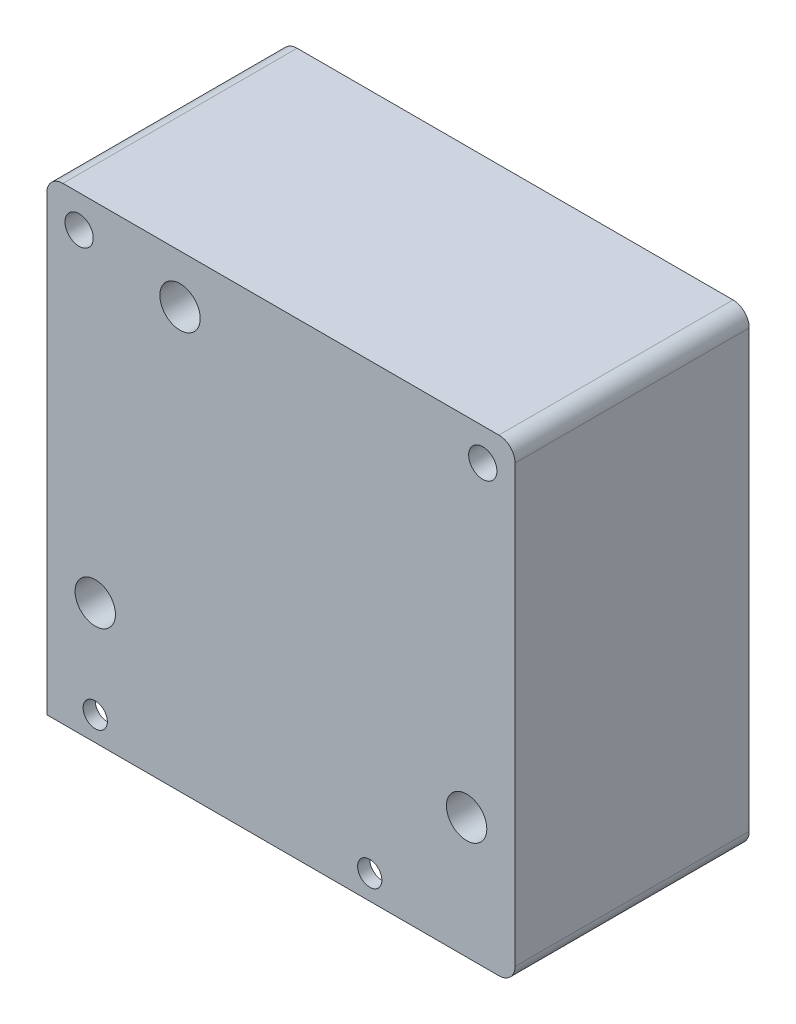
ISO-10303-21;
HEADER;
FILE_DESCRIPTION(('STEP AP214'),'2;1');
FILE_NAME('part.step','',(''),(''),'','','');
FILE_SCHEMA(('AUTOMOTIVE_DESIGN { 1 0 10303 214 1 1 1 1 }'));
ENDSEC;
DATA;
#1=APPLICATION_CONTEXT('core data for automotive mechanical design processes');
#2=APPLICATION_PROTOCOL_DEFINITION('international standard','automotive_design',2000,#1);
#3=PRODUCT_CONTEXT('',#1,'mechanical');
#4=PRODUCT('Part','Part','',(#3));
#5=PRODUCT_RELATED_PRODUCT_CATEGORY('part','',(#4));
#6=PRODUCT_DEFINITION_FORMATION('','',#4);
#7=PRODUCT_DEFINITION_CONTEXT('part definition',#1,'design');
#8=PRODUCT_DEFINITION('design','',#6,#7);
#9=PRODUCT_DEFINITION_SHAPE('','',#8);
#10=(LENGTH_UNIT() NAMED_UNIT(*) SI_UNIT(.MILLI.,.METRE.));
#11=(NAMED_UNIT(*) PLANE_ANGLE_UNIT() SI_UNIT($,.RADIAN.));
#12=(NAMED_UNIT(*) SI_UNIT($,.STERADIAN.) SOLID_ANGLE_UNIT());
#13=UNCERTAINTY_MEASURE_WITH_UNIT(LENGTH_MEASURE(1.E-05),#10,'distance_accuracy_value','');
#14=(GEOMETRIC_REPRESENTATION_CONTEXT(3) GLOBAL_UNCERTAINTY_ASSIGNED_CONTEXT((#13)) GLOBAL_UNIT_ASSIGNED_CONTEXT((#10,
#11,#12)) REPRESENTATION_CONTEXT('',''));
#15=CARTESIAN_POINT('',(0.,0.,0.));
#16=DIRECTION('',(0.,0.,1.));
#17=DIRECTION('',(1.,0.,0.));
#18=AXIS2_PLACEMENT_3D('',#15,#16,#17);
#19=CARTESIAN_POINT('',(-28.9999999999998,0.,29.));
#20=DIRECTION('',(1.,0.,0.));
#21=DIRECTION('',(0.,1.,0.));
#22=AXIS2_PLACEMENT_3D('',#19,#20,#21);
#23=PLANE('',#22);
#24=DIRECTION('',(0.,0.,-1.));
#25=VECTOR('',#24,1.);
#26=CARTESIAN_POINT('',(-28.9999999999998,-23.0000000000005,27.5));
#27=LINE('',#26,#25);
#28=CARTESIAN_POINT('',(-28.9999999999998,-23.0000000000005,27.5));
#29=VERTEX_POINT('',#28);
#30=CARTESIAN_POINT('',(-28.9999999999998,-23.0000000000005,0.));
#31=VERTEX_POINT('',#30);
#32=EDGE_CURVE('E160',#29,#31,#27,.T.);
#33=ORIENTED_EDGE('',*,*,#32,.F.);
#34=DIRECTION('',(0.,-1.,0.));
#35=VECTOR('',#34,1.);
#36=CARTESIAN_POINT('',(-28.9999999999985,1.64336137290879E-12,27.5));
#37=LINE('',#36,#35);
#38=CARTESIAN_POINT('',(-29.0000000000002,-28.9999999999998,27.5));
#39=VERTEX_POINT('',#38);
#40=EDGE_CURVE('E225',#29,#39,#37,.T.);
#41=ORIENTED_EDGE('',*,*,#40,.T.);
#42=DIRECTION('',(0.,0.,-1.));
#43=VECTOR('',#42,1.);
#44=CARTESIAN_POINT('',(-29.0000000000002,-28.9999999999998,29.));
#45=LINE('',#44,#43);
#46=CARTESIAN_POINT('',(-29.0000000000002,-28.9999999999998,29.));
#47=VERTEX_POINT('',#46);
#48=EDGE_CURVE('E11',#47,#39,#45,.T.);
#49=ORIENTED_EDGE('',*,*,#48,.F.);
#50=DIRECTION('',(0.,-1.,0.));
#51=VECTOR('',#50,1.);
#52=CARTESIAN_POINT('',(-28.9999999999998,0.,29.));
#53=LINE('',#52,#51);
#54=CARTESIAN_POINT('',(-28.9999999999998,27.0000000000002,29.));
#55=VERTEX_POINT('',#54);
#56=EDGE_CURVE('E185',#55,#47,#53,.T.);
#57=ORIENTED_EDGE('',*,*,#56,.F.);
#58=DIRECTION('',(0.,0.,-1.));
#59=VECTOR('',#58,1.);
#60=CARTESIAN_POINT('',(-28.9999999999998,27.0000000000002,29.));
#61=LINE('',#60,#59);
#62=CARTESIAN_POINT('',(-28.9999999999998,27.0000000000002,0.));
#63=VERTEX_POINT('',#62);
#64=EDGE_CURVE('E155',#55,#63,#61,.T.);
#65=ORIENTED_EDGE('',*,*,#64,.T.);
#66=DIRECTION('',(0.,-1.,0.));
#67=VECTOR('',#66,1.);
#68=CARTESIAN_POINT('',(-28.9999999999998,0.,0.));
#69=LINE('',#68,#67);
#70=EDGE_CURVE('E156',#63,#31,#69,.T.);
#71=ORIENTED_EDGE('',*,*,#70,.T.);
#72=EDGE_LOOP('',(#33,#41,#49,#57,#65,#71));
#73=FACE_BOUND('',#72,.T.);
#74=ADVANCED_FACE('F35',(#73),#23,.F.);
#75=CARTESIAN_POINT('',(0.,-29.0000000000002,29.));
#76=DIRECTION('',(0.,1.,0.));
#77=DIRECTION('',(0.,0.,1.));
#78=AXIS2_PLACEMENT_3D('',#75,#76,#77);
#79=PLANE('',#78);
#80=DIRECTION('',(0.,0.,-1.));
#81=VECTOR('',#80,1.);
#82=CARTESIAN_POINT('',(17.5000000000005,-29.0000000000002,27.5));
#83=LINE('',#82,#81);
#84=CARTESIAN_POINT('',(17.5000000000005,-29.0000000000002,27.5));
#85=VERTEX_POINT('',#84);
#86=CARTESIAN_POINT('',(17.5000000000005,-29.0000000000002,0.));
#87=VERTEX_POINT('',#86);
#88=EDGE_CURVE('E210',#85,#87,#83,.T.);
#89=ORIENTED_EDGE('',*,*,#88,.T.);
#90=DIRECTION('',(1.,0.,0.));
#91=VECTOR('',#90,1.);
#92=CARTESIAN_POINT('',(0.,-29.0000000000002,0.));
#93=LINE('',#92,#91);
#94=CARTESIAN_POINT('',(26.9999999999998,-29.0000000000002,0.));
#95=VERTEX_POINT('',#94);
#96=EDGE_CURVE('E159',#87,#95,#93,.T.);
#97=ORIENTED_EDGE('',*,*,#96,.T.);
#98=DIRECTION('',(0.,0.,-1.));
#99=VECTOR('',#98,1.);
#100=CARTESIAN_POINT('',(26.9999999999998,-29.0000000000002,29.));
#101=LINE('',#100,#99);
#102=CARTESIAN_POINT('',(26.9999999999998,-29.0000000000002,29.));
#103=VERTEX_POINT('',#102);
#104=EDGE_CURVE('E42',#103,#95,#101,.T.);
#105=ORIENTED_EDGE('',*,*,#104,.F.);
#106=DIRECTION('',(1.,0.,0.));
#107=VECTOR('',#106,1.);
#108=CARTESIAN_POINT('',(0.,-29.0000000000002,29.));
#109=LINE('',#108,#107);
#110=EDGE_CURVE('E93',#47,#103,#109,.T.);
#111=ORIENTED_EDGE('',*,*,#110,.F.);
#112=ORIENTED_EDGE('',*,*,#48,.T.);
#113=DIRECTION('',(1.,0.,0.));
#114=VECTOR('',#113,1.);
#115=CARTESIAN_POINT('',(-2.03391664323128E-13,-29.,27.5));
#116=LINE('',#115,#114);
#117=EDGE_CURVE('E222',#39,#85,#116,.T.);
#118=ORIENTED_EDGE('',*,*,#117,.T.);
#119=EDGE_LOOP('',(#89,#97,#105,#111,#112,#118));
#120=FACE_BOUND('',#119,.T.);
#121=ADVANCED_FACE('F267',(#120),#79,.F.);
#122=CARTESIAN_POINT('',(0.,0.,0.));
#123=DIRECTION('',(0.,0.,1.));
#124=DIRECTION('',(1.,0.,0.));
#125=AXIS2_PLACEMENT_3D('',#122,#123,#124);
#126=PLANE('',#125);
#127=CARTESIAN_POINT('',(-24.9999999999998,25.0000000000002,0.));
#128=DIRECTION('',(0.,0.,1.));
#129=DIRECTION('',(1.,0.,0.));
#130=AXIS2_PLACEMENT_3D('',#127,#128,#129);
#131=CIRCLE('',#130,1.75);
#132=CARTESIAN_POINT('',(-23.2499999999999,25.0000000000002,0.));
#133=VERTEX_POINT('',#132);
#134=EDGE_CURVE('E182',#133,#133,#131,.T.);
#135=ORIENTED_EDGE('',*,*,#134,.T.);
#136=EDGE_LOOP('',(#135));
#137=FACE_BOUND('',#136,.T.);
#138=CARTESIAN_POINT('',(-12.4999999999999,23.0000000000001,0.));
#139=DIRECTION('',(0.,0.,1.));
#140=DIRECTION('',(1.,0.,0.));
#141=AXIS2_PLACEMENT_3D('',#138,#139,#140);
#142=CIRCLE('',#141,2.5);
#143=CARTESIAN_POINT('',(-9.99999999999986,23.0000000000001,0.));
#144=VERTEX_POINT('',#143);
#145=EDGE_CURVE('E179',#144,#144,#142,.T.);
#146=ORIENTED_EDGE('',*,*,#145,.T.);
#147=EDGE_LOOP('',(#146));
#148=FACE_BOUND('',#147,.T.);
#149=CARTESIAN_POINT('',(25.0000000000002,24.9999999999999,0.));
#150=DIRECTION('',(0.,0.,1.));
#151=DIRECTION('',(1.,0.,0.));
#152=AXIS2_PLACEMENT_3D('',#149,#150,#151);
#153=CIRCLE('',#152,1.75);
#154=CARTESIAN_POINT('',(26.7500000000002,24.9999999999999,0.));
#155=VERTEX_POINT('',#154);
#156=EDGE_CURVE('E176',#155,#155,#153,.T.);
#157=ORIENTED_EDGE('',*,*,#156,.T.);
#158=EDGE_LOOP('',(#157));
#159=FACE_BOUND('',#158,.T.);
#160=CARTESIAN_POINT('',(-23.0000000000001,-13.9999999999999,0.));
#161=DIRECTION('',(0.,0.,1.));
#162=DIRECTION('',(1.,0.,0.));
#163=AXIS2_PLACEMENT_3D('',#160,#161,#162);
#164=CIRCLE('',#163,2.49999999999999);
#165=CARTESIAN_POINT('',(-20.5000000000001,-13.9999999999999,0.));
#166=VERTEX_POINT('',#165);
#167=EDGE_CURVE('E173',#166,#166,#164,.T.);
#168=ORIENTED_EDGE('',*,*,#167,.T.);
#169=EDGE_LOOP('',(#168));
#170=FACE_BOUND('',#169,.T.);
#171=CARTESIAN_POINT('',(22.9999999999999,-14.0000000000001,0.));
#172=DIRECTION('',(0.,0.,1.));
#173=DIRECTION('',(1.,0.,0.));
#174=AXIS2_PLACEMENT_3D('',#171,#172,#173);
#175=CIRCLE('',#174,2.49999999999999);
#176=CARTESIAN_POINT('',(25.4999999999999,-14.0000000000001,0.));
#177=VERTEX_POINT('',#176);
#178=EDGE_CURVE('E170',#177,#177,#175,.T.);
#179=ORIENTED_EDGE('',*,*,#178,.T.);
#180=EDGE_LOOP('',(#179));
#181=FACE_BOUND('',#180,.T.);
#182=DIRECTION('',(-1.,0.,0.));
#183=VECTOR('',#182,1.);
#184=CARTESIAN_POINT('',(0.,-23.0000000000005,0.));
#185=LINE('',#184,#183);
#186=CARTESIAN_POINT('',(17.5000000000005,-23.0000000000005,0.));
#187=VERTEX_POINT('',#186);
#188=EDGE_CURVE('E49',#187,#31,#185,.T.);
#189=ORIENTED_EDGE('',*,*,#188,.T.);
#190=ORIENTED_EDGE('',*,*,#70,.F.);
#191=CARTESIAN_POINT('',(-26.9999999999998,27.0000000000002,0.));
#192=DIRECTION('',(0.,0.,1.));
#193=DIRECTION('',(1.,0.,0.));
#194=AXIS2_PLACEMENT_3D('',#191,#192,#193);
#195=CIRCLE('',#194,2.);
#196=CARTESIAN_POINT('',(-26.9999999999998,29.0000000000002,0.));
#197=VERTEX_POINT('',#196);
#198=EDGE_CURVE('E85',#197,#63,#195,.T.);
#199=ORIENTED_EDGE('',*,*,#198,.F.);
#200=DIRECTION('',(-1.,0.,0.));
#201=VECTOR('',#200,1.);
#202=CARTESIAN_POINT('',(1.7141637903356E-13,29.,0.));
#203=LINE('',#202,#201);
#204=CARTESIAN_POINT('',(27.0000000000002,28.9999999999998,0.));
#205=VERTEX_POINT('',#204);
#206=EDGE_CURVE('E167',#205,#197,#203,.T.);
#207=ORIENTED_EDGE('',*,*,#206,.F.);
#208=CARTESIAN_POINT('',(27.0000000000002,26.9999999999998,0.));
#209=DIRECTION('',(0.,0.,1.));
#210=DIRECTION('',(1.,0.,0.));
#211=AXIS2_PLACEMENT_3D('',#208,#209,#210);
#212=CIRCLE('',#211,2.);
#213=CARTESIAN_POINT('',(29.0000000000002,26.9999999999998,0.));
#214=VERTEX_POINT('',#213);
#215=EDGE_CURVE('E123',#214,#205,#212,.T.);
#216=ORIENTED_EDGE('',*,*,#215,.F.);
#217=DIRECTION('',(0.,1.,0.));
#218=VECTOR('',#217,1.);
#219=CARTESIAN_POINT('',(29.,-1.78869265078497E-13,0.));
#220=LINE('',#219,#218);
#221=CARTESIAN_POINT('',(28.9999999999998,-27.0000000000002,0.));
#222=VERTEX_POINT('',#221);
#223=EDGE_CURVE('E164',#222,#214,#220,.T.);
#224=ORIENTED_EDGE('',*,*,#223,.F.);
#225=CARTESIAN_POINT('',(26.9999999999998,-27.0000000000002,0.));
#226=DIRECTION('',(0.,0.,1.));
#227=DIRECTION('',(1.,0.,0.));
#228=AXIS2_PLACEMENT_3D('',#225,#226,#227);
#229=CIRCLE('',#228,2.);
#230=EDGE_CURVE('E162',#95,#222,#229,.T.);
#231=ORIENTED_EDGE('',*,*,#230,.F.);
#232=ORIENTED_EDGE('',*,*,#96,.F.);
#233=DIRECTION('',(0.,1.,0.));
#234=VECTOR('',#233,1.);
#235=CARTESIAN_POINT('',(17.5000000000005,0.,0.));
#236=LINE('',#235,#234);
#237=EDGE_CURVE('E216',#87,#187,#236,.T.);
#238=ORIENTED_EDGE('',*,*,#237,.T.);
#239=EDGE_LOOP('',(#189,#190,#199,#207,#216,#224,#231,#232,#238));
#240=FACE_BOUND('',#239,.T.);
#241=ADVANCED_FACE('F201',(#137,#148,#159,#170,#181,#240),#126,.F.);
#242=CARTESIAN_POINT('',(26.9999999999998,-27.0000000000002,29.));
#243=DIRECTION('',(0.,0.,-1.));
#244=DIRECTION('',(-1.,0.,0.));
#245=AXIS2_PLACEMENT_3D('',#242,#243,#244);
#246=CYLINDRICAL_SURFACE('',#245,2.);
#247=ORIENTED_EDGE('',*,*,#230,.T.);
#248=DIRECTION('',(0.,0.,-1.));
#249=VECTOR('',#248,1.);
#250=CARTESIAN_POINT('',(28.9999999999998,-27.0000000000002,29.));
#251=LINE('',#250,#249);
#252=CARTESIAN_POINT('',(28.9999999999998,-27.0000000000002,29.));
#253=VERTEX_POINT('',#252);
#254=EDGE_CURVE('E189',#253,#222,#251,.T.);
#255=ORIENTED_EDGE('',*,*,#254,.F.);
#256=CARTESIAN_POINT('',(26.9999999999998,-27.0000000000002,29.));
#257=DIRECTION('',(0.,0.,1.));
#258=DIRECTION('',(1.,0.,0.));
#259=AXIS2_PLACEMENT_3D('',#256,#257,#258);
#260=CIRCLE('',#259,2.);
#261=EDGE_CURVE('E197',#103,#253,#260,.T.);
#262=ORIENTED_EDGE('',*,*,#261,.F.);
#263=ORIENTED_EDGE('',*,*,#104,.T.);
#264=EDGE_LOOP('',(#247,#255,#262,#263));
#265=FACE_BOUND('',#264,.T.);
#266=ADVANCED_FACE('F195',(#265),#246,.T.);
#267=CARTESIAN_POINT('',(29.,-1.78869265078497E-13,29.));
#268=DIRECTION('',(-1.,0.,0.));
#269=DIRECTION('',(0.,-1.,0.));
#270=AXIS2_PLACEMENT_3D('',#267,#268,#269);
#271=PLANE('',#270);
#272=ORIENTED_EDGE('',*,*,#223,.T.);
#273=DIRECTION('',(0.,0.,-1.));
#274=VECTOR('',#273,1.);
#275=CARTESIAN_POINT('',(29.0000000000002,26.9999999999998,29.));
#276=LINE('',#275,#274);
#277=CARTESIAN_POINT('',(29.0000000000002,26.9999999999998,29.));
#278=VERTEX_POINT('',#277);
#279=EDGE_CURVE('E126',#278,#214,#276,.T.);
#280=ORIENTED_EDGE('',*,*,#279,.F.);
#281=DIRECTION('',(0.,1.,0.));
#282=VECTOR('',#281,1.);
#283=CARTESIAN_POINT('',(29.,-1.78869265078497E-13,29.));
#284=LINE('',#283,#282);
#285=EDGE_CURVE('E114',#253,#278,#284,.T.);
#286=ORIENTED_EDGE('',*,*,#285,.F.);
#287=ORIENTED_EDGE('',*,*,#254,.T.);
#288=EDGE_LOOP('',(#272,#280,#286,#287));
#289=FACE_BOUND('',#288,.T.);
#290=ADVANCED_FACE('F204',(#289),#271,.F.);
#291=CARTESIAN_POINT('',(27.0000000000002,26.9999999999998,29.));
#292=DIRECTION('',(0.,0.,-1.));
#293=DIRECTION('',(-1.,0.,0.));
#294=AXIS2_PLACEMENT_3D('',#291,#292,#293);
#295=CYLINDRICAL_SURFACE('',#294,2.);
#296=ORIENTED_EDGE('',*,*,#215,.T.);
#297=DIRECTION('',(0.,0.,-1.));
#298=VECTOR('',#297,1.);
#299=CARTESIAN_POINT('',(27.0000000000002,28.9999999999998,29.));
#300=LINE('',#299,#298);
#301=CARTESIAN_POINT('',(27.0000000000002,28.9999999999998,29.));
#302=VERTEX_POINT('',#301);
#303=EDGE_CURVE('E120',#302,#205,#300,.T.);
#304=ORIENTED_EDGE('',*,*,#303,.F.);
#305=CARTESIAN_POINT('',(27.0000000000002,26.9999999999998,29.));
#306=DIRECTION('',(0.,0.,1.));
#307=DIRECTION('',(1.,0.,0.));
#308=AXIS2_PLACEMENT_3D('',#305,#306,#307);
#309=CIRCLE('',#308,2.);
#310=EDGE_CURVE('E106',#278,#302,#309,.T.);
#311=ORIENTED_EDGE('',*,*,#310,.F.);
#312=ORIENTED_EDGE('',*,*,#279,.T.);
#313=EDGE_LOOP('',(#296,#304,#311,#312));
#314=FACE_BOUND('',#313,.T.);
#315=ADVANCED_FACE('F121',(#314),#295,.T.);
#316=CARTESIAN_POINT('',(1.7141637903356E-13,29.,29.));
#317=DIRECTION('',(0.,-1.,0.));
#318=DIRECTION('',(1.,0.,0.));
#319=AXIS2_PLACEMENT_3D('',#316,#317,#318);
#320=PLANE('',#319);
#321=ORIENTED_EDGE('',*,*,#206,.T.);
#322=DIRECTION('',(0.,0.,-1.));
#323=VECTOR('',#322,1.);
#324=CARTESIAN_POINT('',(-26.9999999999998,29.0000000000002,29.));
#325=LINE('',#324,#323);
#326=CARTESIAN_POINT('',(-26.9999999999998,29.0000000000002,29.));
#327=VERTEX_POINT('',#326);
#328=EDGE_CURVE('E127',#327,#197,#325,.T.);
#329=ORIENTED_EDGE('',*,*,#328,.F.);
#330=DIRECTION('',(-1.,0.,0.));
#331=VECTOR('',#330,1.);
#332=CARTESIAN_POINT('',(1.7141637903356E-13,29.,29.));
#333=LINE('',#332,#331);
#334=EDGE_CURVE('E111',#302,#327,#333,.T.);
#335=ORIENTED_EDGE('',*,*,#334,.F.);
#336=ORIENTED_EDGE('',*,*,#303,.T.);
#337=EDGE_LOOP('',(#321,#329,#335,#336));
#338=FACE_BOUND('',#337,.T.);
#339=ADVANCED_FACE('F129',(#338),#320,.F.);
#340=CARTESIAN_POINT('',(10.9999999999998,-26.0000000000001,29.));
#341=DIRECTION('',(0.,0.,-1.));
#342=DIRECTION('',(-1.,0.,0.));
#343=AXIS2_PLACEMENT_3D('',#340,#341,#342);
#344=CYLINDRICAL_SURFACE('',#343,1.5);
#345=CARTESIAN_POINT('',(10.9999999999998,-26.0000000000001,27.5));
#346=DIRECTION('',(0.,0.,1.));
#347=DIRECTION('',(1.,0.,0.));
#348=AXIS2_PLACEMENT_3D('',#345,#346,#347);
#349=CIRCLE('',#348,1.5);
#350=CARTESIAN_POINT('',(12.4999999999998,-26.0000000000001,27.5));
#351=VERTEX_POINT('',#350);
#352=EDGE_CURVE('E218',#351,#351,#349,.T.);
#353=ORIENTED_EDGE('',*,*,#352,.F.);
#354=EDGE_LOOP('',(#353));
#355=FACE_BOUND('',#354,.T.);
#356=CARTESIAN_POINT('',(10.9999999999998,-26.0000000000001,29.));
#357=DIRECTION('',(0.,0.,1.));
#358=DIRECTION('',(1.,0.,0.));
#359=AXIS2_PLACEMENT_3D('',#356,#357,#358);
#360=CIRCLE('',#359,1.5);
#361=CARTESIAN_POINT('',(12.4999999999998,-26.0000000000001,29.));
#362=VERTEX_POINT('',#361);
#363=EDGE_CURVE('E149',#362,#362,#360,.T.);
#364=ORIENTED_EDGE('',*,*,#363,.T.);
#365=EDGE_LOOP('',(#364));
#366=FACE_BOUND('',#365,.T.);
#367=ADVANCED_FACE('F240',(#355,#366),#344,.F.);
#368=CARTESIAN_POINT('',(-24.9999999999998,25.0000000000002,29.));
#369=DIRECTION('',(0.,0.,-1.));
#370=DIRECTION('',(-1.,0.,0.));
#371=AXIS2_PLACEMENT_3D('',#368,#369,#370);
#372=CYLINDRICAL_SURFACE('',#371,1.75);
#373=CARTESIAN_POINT('',(-24.9999999999998,25.0000000000002,29.));
#374=DIRECTION('',(0.,0.,1.));
#375=DIRECTION('',(1.,0.,0.));
#376=AXIS2_PLACEMENT_3D('',#373,#374,#375);
#377=CIRCLE('',#376,1.75);
#378=CARTESIAN_POINT('',(-23.2499999999999,25.0000000000002,29.));
#379=VERTEX_POINT('',#378);
#380=EDGE_CURVE('E146',#379,#379,#377,.T.);
#381=ORIENTED_EDGE('',*,*,#380,.T.);
#382=EDGE_LOOP('',(#381));
#383=FACE_BOUND('',#382,.T.);
#384=ORIENTED_EDGE('',*,*,#134,.F.);
#385=EDGE_LOOP('',(#384));
#386=FACE_BOUND('',#385,.T.);
#387=ADVANCED_FACE('F243',(#383,#386),#372,.F.);
#388=CARTESIAN_POINT('',(-12.4999999999999,23.0000000000001,29.));
#389=DIRECTION('',(0.,0.,-1.));
#390=DIRECTION('',(-1.,0.,0.));
#391=AXIS2_PLACEMENT_3D('',#388,#389,#390);
#392=CYLINDRICAL_SURFACE('',#391,2.5);
#393=CARTESIAN_POINT('',(-12.4999999999999,23.0000000000001,29.));
#394=DIRECTION('',(0.,0.,1.));
#395=DIRECTION('',(1.,0.,0.));
#396=AXIS2_PLACEMENT_3D('',#393,#394,#395);
#397=CIRCLE('',#396,2.5);
#398=CARTESIAN_POINT('',(-9.99999999999986,23.0000000000001,29.));
#399=VERTEX_POINT('',#398);
#400=EDGE_CURVE('E143',#399,#399,#397,.T.);
#401=ORIENTED_EDGE('',*,*,#400,.T.);
#402=EDGE_LOOP('',(#401));
#403=FACE_BOUND('',#402,.T.);
#404=ORIENTED_EDGE('',*,*,#145,.F.);
#405=EDGE_LOOP('',(#404));
#406=FACE_BOUND('',#405,.T.);
#407=ADVANCED_FACE('F359',(#403,#406),#392,.F.);
#408=CARTESIAN_POINT('',(25.0000000000002,24.9999999999999,29.));
#409=DIRECTION('',(0.,0.,-1.));
#410=DIRECTION('',(-1.,0.,0.));
#411=AXIS2_PLACEMENT_3D('',#408,#409,#410);
#412=CYLINDRICAL_SURFACE('',#411,1.75);
#413=CARTESIAN_POINT('',(25.0000000000002,24.9999999999999,29.));
#414=DIRECTION('',(0.,0.,1.));
#415=DIRECTION('',(1.,0.,0.));
#416=AXIS2_PLACEMENT_3D('',#413,#414,#415);
#417=CIRCLE('',#416,1.75);
#418=CARTESIAN_POINT('',(26.7500000000002,24.9999999999999,29.));
#419=VERTEX_POINT('',#418);
#420=EDGE_CURVE('E140',#419,#419,#417,.T.);
#421=ORIENTED_EDGE('',*,*,#420,.T.);
#422=EDGE_LOOP('',(#421));
#423=FACE_BOUND('',#422,.T.);
#424=ORIENTED_EDGE('',*,*,#156,.F.);
#425=EDGE_LOOP('',(#424));
#426=FACE_BOUND('',#425,.T.);
#427=ADVANCED_FACE('F324',(#423,#426),#412,.F.);
#428=CARTESIAN_POINT('',(-23.0000000000001,-13.9999999999999,29.));
#429=DIRECTION('',(0.,0.,-1.));
#430=DIRECTION('',(-1.,0.,0.));
#431=AXIS2_PLACEMENT_3D('',#428,#429,#430);
#432=CYLINDRICAL_SURFACE('',#431,2.49999999999999);
#433=CARTESIAN_POINT('',(-23.0000000000001,-13.9999999999999,29.));
#434=DIRECTION('',(0.,0.,1.));
#435=DIRECTION('',(1.,0.,0.));
#436=AXIS2_PLACEMENT_3D('',#433,#434,#435);
#437=CIRCLE('',#436,2.49999999999999);
#438=CARTESIAN_POINT('',(-20.5000000000001,-13.9999999999999,29.));
#439=VERTEX_POINT('',#438);
#440=EDGE_CURVE('E137',#439,#439,#437,.T.);
#441=ORIENTED_EDGE('',*,*,#440,.T.);
#442=EDGE_LOOP('',(#441));
#443=FACE_BOUND('',#442,.T.);
#444=ORIENTED_EDGE('',*,*,#167,.F.);
#445=EDGE_LOOP('',(#444));
#446=FACE_BOUND('',#445,.T.);
#447=ADVANCED_FACE('F318',(#443,#446),#432,.F.);
#448=CARTESIAN_POINT('',(22.9999999999999,-14.0000000000001,29.));
#449=DIRECTION('',(0.,0.,-1.));
#450=DIRECTION('',(-1.,0.,0.));
#451=AXIS2_PLACEMENT_3D('',#448,#449,#450);
#452=CYLINDRICAL_SURFACE('',#451,2.49999999999999);
#453=CARTESIAN_POINT('',(22.9999999999999,-14.0000000000001,29.));
#454=DIRECTION('',(0.,0.,1.));
#455=DIRECTION('',(1.,0.,0.));
#456=AXIS2_PLACEMENT_3D('',#453,#454,#455);
#457=CIRCLE('',#456,2.49999999999999);
#458=CARTESIAN_POINT('',(25.4999999999999,-14.0000000000001,29.));
#459=VERTEX_POINT('',#458);
#460=EDGE_CURVE('E131',#459,#459,#457,.T.);
#461=ORIENTED_EDGE('',*,*,#460,.T.);
#462=EDGE_LOOP('',(#461));
#463=FACE_BOUND('',#462,.T.);
#464=ORIENTED_EDGE('',*,*,#178,.F.);
#465=EDGE_LOOP('',(#464));
#466=FACE_BOUND('',#465,.T.);
#467=ADVANCED_FACE('F262',(#463,#466),#452,.F.);
#468=CARTESIAN_POINT('',(-26.9999999999998,27.0000000000002,29.));
#469=DIRECTION('',(0.,0.,-1.));
#470=DIRECTION('',(-1.,0.,0.));
#471=AXIS2_PLACEMENT_3D('',#468,#469,#470);
#472=CYLINDRICAL_SURFACE('',#471,2.);
#473=ORIENTED_EDGE('',*,*,#198,.T.);
#474=ORIENTED_EDGE('',*,*,#64,.F.);
#475=CARTESIAN_POINT('',(-26.9999999999998,27.0000000000002,29.));
#476=DIRECTION('',(0.,0.,1.));
#477=DIRECTION('',(1.,0.,0.));
#478=AXIS2_PLACEMENT_3D('',#475,#476,#477);
#479=CIRCLE('',#478,2.);
#480=EDGE_CURVE('E58',#327,#55,#479,.T.);
#481=ORIENTED_EDGE('',*,*,#480,.F.);
#482=ORIENTED_EDGE('',*,*,#328,.T.);
#483=EDGE_LOOP('',(#473,#474,#481,#482));
#484=FACE_BOUND('',#483,.T.);
#485=ADVANCED_FACE('F255',(#484),#472,.T.);
#486=CARTESIAN_POINT('',(-23.0000000000002,-25.9999999999999,29.));
#487=DIRECTION('',(0.,0.,-1.));
#488=DIRECTION('',(-1.,0.,0.));
#489=AXIS2_PLACEMENT_3D('',#486,#487,#488);
#490=CYLINDRICAL_SURFACE('',#489,1.5);
#491=CARTESIAN_POINT('',(-23.0000000000002,-25.9999999999999,27.5));
#492=DIRECTION('',(0.,0.,1.));
#493=DIRECTION('',(1.,0.,0.));
#494=AXIS2_PLACEMENT_3D('',#491,#492,#493);
#495=CIRCLE('',#494,1.5);
#496=CARTESIAN_POINT('',(-21.5000000000001,-25.9999999999999,27.5));
#497=VERTEX_POINT('',#496);
#498=EDGE_CURVE('E231',#497,#497,#495,.T.);
#499=ORIENTED_EDGE('',*,*,#498,.F.);
#500=EDGE_LOOP('',(#499));
#501=FACE_BOUND('',#500,.T.);
#502=CARTESIAN_POINT('',(-23.0000000000002,-25.9999999999999,29.));
#503=DIRECTION('',(0.,0.,1.));
#504=DIRECTION('',(1.,0.,0.));
#505=AXIS2_PLACEMENT_3D('',#502,#503,#504);
#506=CIRCLE('',#505,1.5);
#507=CARTESIAN_POINT('',(-21.5000000000001,-25.9999999999999,29.));
#508=VERTEX_POINT('',#507);
#509=EDGE_CURVE('E152',#508,#508,#506,.T.);
#510=ORIENTED_EDGE('',*,*,#509,.T.);
#511=EDGE_LOOP('',(#510));
#512=FACE_BOUND('',#511,.T.);
#513=ADVANCED_FACE('F250',(#501,#512),#490,.F.);
#514=CARTESIAN_POINT('',(0.,0.,29.));
#515=DIRECTION('',(0.,0.,1.));
#516=DIRECTION('',(1.,0.,0.));
#517=AXIS2_PLACEMENT_3D('',#514,#515,#516);
#518=PLANE('',#517);
#519=ORIENTED_EDGE('',*,*,#56,.T.);
#520=ORIENTED_EDGE('',*,*,#110,.T.);
#521=ORIENTED_EDGE('',*,*,#261,.T.);
#522=ORIENTED_EDGE('',*,*,#285,.T.);
#523=ORIENTED_EDGE('',*,*,#310,.T.);
#524=ORIENTED_EDGE('',*,*,#334,.T.);
#525=ORIENTED_EDGE('',*,*,#480,.T.);
#526=EDGE_LOOP('',(#519,#520,#521,#522,#523,#524,#525));
#527=FACE_BOUND('',#526,.T.);
#528=ORIENTED_EDGE('',*,*,#460,.F.);
#529=EDGE_LOOP('',(#528));
#530=FACE_BOUND('',#529,.T.);
#531=ORIENTED_EDGE('',*,*,#440,.F.);
#532=EDGE_LOOP('',(#531));
#533=FACE_BOUND('',#532,.T.);
#534=ORIENTED_EDGE('',*,*,#420,.F.);
#535=EDGE_LOOP('',(#534));
#536=FACE_BOUND('',#535,.T.);
#537=ORIENTED_EDGE('',*,*,#400,.F.);
#538=EDGE_LOOP('',(#537));
#539=FACE_BOUND('',#538,.T.);
#540=ORIENTED_EDGE('',*,*,#380,.F.);
#541=EDGE_LOOP('',(#540));
#542=FACE_BOUND('',#541,.T.);
#543=ORIENTED_EDGE('',*,*,#363,.F.);
#544=EDGE_LOOP('',(#543));
#545=FACE_BOUND('',#544,.T.);
#546=ORIENTED_EDGE('',*,*,#509,.F.);
#547=EDGE_LOOP('',(#546));
#548=FACE_BOUND('',#547,.T.);
#549=ADVANCED_FACE('F108',(#527,#530,#533,#536,#539,#542,#545,#548),#518,.T.);
#550=CARTESIAN_POINT('',(0.,-23.0000000000005,27.5));
#551=DIRECTION('',(0.,-1.,0.));
#552=DIRECTION('',(1.,0.,0.));
#553=AXIS2_PLACEMENT_3D('',#550,#551,#552);
#554=PLANE('',#553);
#555=ORIENTED_EDGE('',*,*,#188,.F.);
#556=DIRECTION('',(0.,0.,-1.));
#557=VECTOR('',#556,1.);
#558=CARTESIAN_POINT('',(17.5000000000005,-23.0000000000005,27.5));
#559=LINE('',#558,#557);
#560=CARTESIAN_POINT('',(17.5000000000005,-23.0000000000005,27.5));
#561=VERTEX_POINT('',#560);
#562=EDGE_CURVE('E213',#561,#187,#559,.T.);
#563=ORIENTED_EDGE('',*,*,#562,.F.);
#564=DIRECTION('',(-1.,0.,0.));
#565=VECTOR('',#564,1.);
#566=CARTESIAN_POINT('',(0.,-23.0000000000005,27.5));
#567=LINE('',#566,#565);
#568=EDGE_CURVE('E228',#561,#29,#567,.T.);
#569=ORIENTED_EDGE('',*,*,#568,.T.);
#570=ORIENTED_EDGE('',*,*,#32,.T.);
#571=EDGE_LOOP('',(#555,#563,#569,#570));
#572=FACE_BOUND('',#571,.T.);
#573=ADVANCED_FACE('F249',(#572),#554,.T.);
#574=CARTESIAN_POINT('',(17.5000000000005,0.,27.5));
#575=DIRECTION('',(-1.,0.,0.));
#576=DIRECTION('',(0.,-1.,0.));
#577=AXIS2_PLACEMENT_3D('',#574,#575,#576);
#578=PLANE('',#577);
#579=ORIENTED_EDGE('',*,*,#237,.F.);
#580=ORIENTED_EDGE('',*,*,#88,.F.);
#581=DIRECTION('',(0.,1.,0.));
#582=VECTOR('',#581,1.);
#583=CARTESIAN_POINT('',(17.5000000000005,0.,27.5));
#584=LINE('',#583,#582);
#585=EDGE_CURVE('E215',#85,#561,#584,.T.);
#586=ORIENTED_EDGE('',*,*,#585,.T.);
#587=ORIENTED_EDGE('',*,*,#562,.T.);
#588=EDGE_LOOP('',(#579,#580,#586,#587));
#589=FACE_BOUND('',#588,.T.);
#590=ADVANCED_FACE('F285',(#589),#578,.T.);
#591=CARTESIAN_POINT('',(0.,0.,27.5));
#592=DIRECTION('',(0.,0.,1.));
#593=DIRECTION('',(1.,0.,0.));
#594=AXIS2_PLACEMENT_3D('',#591,#592,#593);
#595=PLANE('',#594);
#596=ORIENTED_EDGE('',*,*,#352,.T.);
#597=EDGE_LOOP('',(#596));
#598=FACE_BOUND('',#597,.T.);
#599=ORIENTED_EDGE('',*,*,#498,.T.);
#600=EDGE_LOOP('',(#599));
#601=FACE_BOUND('',#600,.T.);
#602=ORIENTED_EDGE('',*,*,#568,.F.);
#603=ORIENTED_EDGE('',*,*,#585,.F.);
#604=ORIENTED_EDGE('',*,*,#117,.F.);
#605=ORIENTED_EDGE('',*,*,#40,.F.);
#606=EDGE_LOOP('',(#602,#603,#604,#605));
#607=FACE_BOUND('',#606,.T.);
#608=ADVANCED_FACE('F237',(#598,#601,#607),#595,.F.);
#609=CLOSED_SHELL('',(#74,#121,#241,#266,#290,#315,#339,#367,#387,#407,#427,#447,#467,#485,#513,
#549,#573,#590,#608));
#610=MANIFOLD_SOLID_BREP('B2',#609);
#611=ADVANCED_BREP_SHAPE_REPRESENTATION('',(#18,#610),#14);
#612=SHAPE_DEFINITION_REPRESENTATION(#9,#611);
ENDSEC;
END-ISO-10303-21;
